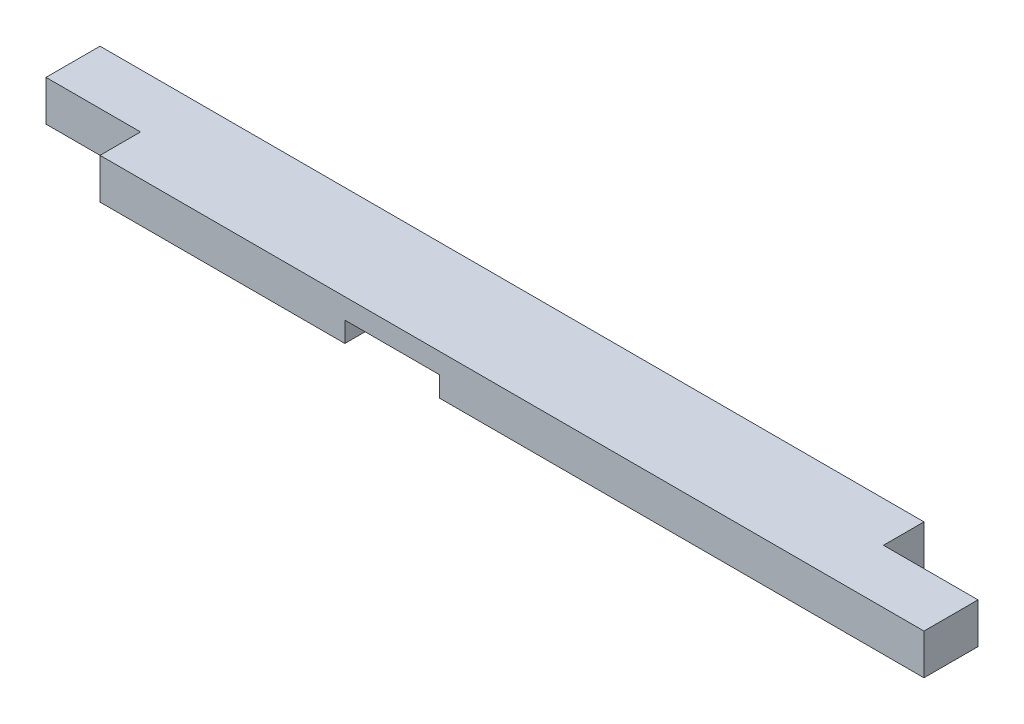
ISO-10303-21;
HEADER;
FILE_DESCRIPTION(('STEP AP214'),'2;1');
FILE_NAME('part.step','',(''),(''),'','','');
FILE_SCHEMA(('AUTOMOTIVE_DESIGN { 1 0 10303 214 1 1 1 1 }'));
ENDSEC;
DATA;
#1=APPLICATION_CONTEXT('core data for automotive mechanical design processes');
#2=APPLICATION_PROTOCOL_DEFINITION('international standard','automotive_design',2000,#1);
#3=PRODUCT_CONTEXT('',#1,'mechanical');
#4=PRODUCT('Part','Part','',(#3));
#5=PRODUCT_RELATED_PRODUCT_CATEGORY('part','',(#4));
#6=PRODUCT_DEFINITION_FORMATION('','',#4);
#7=PRODUCT_DEFINITION_CONTEXT('part definition',#1,'design');
#8=PRODUCT_DEFINITION('design','',#6,#7);
#9=PRODUCT_DEFINITION_SHAPE('','',#8);
#10=(LENGTH_UNIT() NAMED_UNIT(*) SI_UNIT(.MILLI.,.METRE.));
#11=(NAMED_UNIT(*) PLANE_ANGLE_UNIT() SI_UNIT($,.RADIAN.));
#12=(NAMED_UNIT(*) SI_UNIT($,.STERADIAN.) SOLID_ANGLE_UNIT());
#13=UNCERTAINTY_MEASURE_WITH_UNIT(LENGTH_MEASURE(1.E-05),#10,'distance_accuracy_value','');
#14=(GEOMETRIC_REPRESENTATION_CONTEXT(3) GLOBAL_UNCERTAINTY_ASSIGNED_CONTEXT((#13)) GLOBAL_UNIT_ASSIGNED_CONTEXT((#10,
#11,#12)) REPRESENTATION_CONTEXT('',''));
#15=CARTESIAN_POINT('',(0.,0.,0.));
#16=DIRECTION('',(0.,0.,1.));
#17=DIRECTION('',(1.,0.,0.));
#18=AXIS2_PLACEMENT_3D('',#15,#16,#17);
#19=CARTESIAN_POINT('',(0.,0.,0.));
#20=DIRECTION('',(0.,-1.,0.));
#21=DIRECTION('',(0.,0.,-1.));
#22=AXIS2_PLACEMENT_3D('',#19,#20,#21);
#23=PLANE('',#22);
#24=DIRECTION('',(-1.,0.,0.));
#25=VECTOR('',#24,1.);
#26=CARTESIAN_POINT('',(0.,0.,-38.1));
#27=LINE('',#26,#25);
#28=CARTESIAN_POINT('',(88.9,0.,-38.1));
#29=VERTEX_POINT('',#28);
#30=CARTESIAN_POINT('',(0.,0.,-38.1));
#31=VERTEX_POINT('',#30);
#32=EDGE_CURVE('E205',#29,#31,#27,.T.);
#33=ORIENTED_EDGE('',*,*,#32,.T.);
#34=DIRECTION('',(0.,0.,1.));
#35=VECTOR('',#34,1.);
#36=CARTESIAN_POINT('',(0.,0.,0.));
#37=LINE('',#36,#35);
#38=CARTESIAN_POINT('',(0.,0.,-88.9));
#39=VERTEX_POINT('',#38);
#40=EDGE_CURVE('E173',#39,#31,#37,.T.);
#41=ORIENTED_EDGE('',*,*,#40,.F.);
#42=DIRECTION('',(-1.,0.,0.));
#43=VECTOR('',#42,1.);
#44=CARTESIAN_POINT('',(0.,0.,-88.9));
#45=LINE('',#44,#43);
#46=CARTESIAN_POINT('',(319.1002,0.,-88.9));
#47=VERTEX_POINT('',#46);
#48=EDGE_CURVE('E153',#47,#39,#45,.T.);
#49=ORIENTED_EDGE('',*,*,#48,.F.);
#50=DIRECTION('',(0.,0.,-1.));
#51=VECTOR('',#50,1.);
#52=CARTESIAN_POINT('',(319.1002,0.,0.));
#53=LINE('',#52,#51);
#54=CARTESIAN_POINT('',(319.1002,0.,0.));
#55=VERTEX_POINT('',#54);
#56=EDGE_CURVE('E214',#55,#47,#53,.T.);
#57=ORIENTED_EDGE('',*,*,#56,.F.);
#58=DIRECTION('',(1.,0.,0.));
#59=VECTOR('',#58,1.);
#60=CARTESIAN_POINT('',(0.,0.,0.));
#61=LINE('',#60,#59);
#62=CARTESIAN_POINT('',(88.9,0.,0.));
#63=VERTEX_POINT('',#62);
#64=EDGE_CURVE('E176',#63,#55,#61,.T.);
#65=ORIENTED_EDGE('',*,*,#64,.F.);
#66=DIRECTION('',(0.,0.,-1.));
#67=VECTOR('',#66,1.);
#68=CARTESIAN_POINT('',(88.9,0.,0.));
#69=LINE('',#68,#67);
#70=EDGE_CURVE('E202',#63,#29,#69,.T.);
#71=ORIENTED_EDGE('',*,*,#70,.T.);
#72=EDGE_LOOP('',(#33,#41,#49,#57,#65,#71));
#73=FACE_BOUND('',#72,.T.);
#74=ADVANCED_FACE('F39',(#73),#23,.T.);
#75=CARTESIAN_POINT('',(0.,38.1,0.));
#76=DIRECTION('',(1.,0.,0.));
#77=DIRECTION('',(0.,0.,-1.));
#78=AXIS2_PLACEMENT_3D('',#75,#76,#77);
#79=PLANE('',#78);
#80=ORIENTED_EDGE('',*,*,#40,.T.);
#81=DIRECTION('',(0.,1.,0.));
#82=VECTOR('',#81,1.);
#83=CARTESIAN_POINT('',(0.,0.,-38.1));
#84=LINE('',#83,#82);
#85=CARTESIAN_POINT('',(0.,38.1,-38.1));
#86=VERTEX_POINT('',#85);
#87=EDGE_CURVE('E211',#31,#86,#84,.T.);
#88=ORIENTED_EDGE('',*,*,#87,.T.);
#89=DIRECTION('',(0.,0.,1.));
#90=VECTOR('',#89,1.);
#91=CARTESIAN_POINT('',(0.,38.1,0.));
#92=LINE('',#91,#90);
#93=CARTESIAN_POINT('',(0.,38.1,-88.9));
#94=VERTEX_POINT('',#93);
#95=EDGE_CURVE('E152',#94,#86,#92,.T.);
#96=ORIENTED_EDGE('',*,*,#95,.F.);
#97=DIRECTION('',(0.,-1.,0.));
#98=VECTOR('',#97,1.);
#99=CARTESIAN_POINT('',(0.,38.1,-88.9));
#100=LINE('',#99,#98);
#101=EDGE_CURVE('E47',#94,#39,#100,.T.);
#102=ORIENTED_EDGE('',*,*,#101,.T.);
#103=EDGE_LOOP('',(#80,#88,#96,#102));
#104=FACE_BOUND('',#103,.T.);
#105=ADVANCED_FACE('F41',(#104),#79,.F.);
#106=CARTESIAN_POINT('',(0.,38.1,0.));
#107=DIRECTION('',(0.,0.,-1.));
#108=DIRECTION('',(-1.,0.,0.));
#109=AXIS2_PLACEMENT_3D('',#106,#107,#108);
#110=PLANE('',#109);
#111=DIRECTION('',(1.,0.,0.));
#112=VECTOR('',#111,1.);
#113=CARTESIAN_POINT('',(0.,38.1,0.));
#114=LINE('',#113,#112);
#115=CARTESIAN_POINT('',(88.9,38.1,0.));
#116=VERTEX_POINT('',#115);
#117=CARTESIAN_POINT('',(863.6,38.1,0.));
#118=VERTEX_POINT('',#117);
#119=EDGE_CURVE('E156',#116,#118,#114,.T.);
#120=ORIENTED_EDGE('',*,*,#119,.F.);
#121=DIRECTION('',(0.,1.,0.));
#122=VECTOR('',#121,1.);
#123=CARTESIAN_POINT('',(88.9,0.,0.));
#124=LINE('',#123,#122);
#125=EDGE_CURVE('E62',#63,#116,#124,.T.);
#126=ORIENTED_EDGE('',*,*,#125,.F.);
#127=ORIENTED_EDGE('',*,*,#64,.T.);
#128=DIRECTION('',(0.,-1.,0.));
#129=VECTOR('',#128,1.);
#130=CARTESIAN_POINT('',(319.1002,19.05,0.));
#131=LINE('',#130,#129);
#132=CARTESIAN_POINT('',(319.1002,19.05,0.));
#133=VERTEX_POINT('',#132);
#134=EDGE_CURVE('E175',#133,#55,#131,.T.);
#135=ORIENTED_EDGE('',*,*,#134,.F.);
#136=DIRECTION('',(-1.,0.,0.));
#137=VECTOR('',#136,1.);
#138=CARTESIAN_POINT('',(319.1002,19.05,0.));
#139=LINE('',#138,#137);
#140=CARTESIAN_POINT('',(408.0002,19.05,0.));
#141=VERTEX_POINT('',#140);
#142=EDGE_CURVE('E227',#141,#133,#139,.T.);
#143=ORIENTED_EDGE('',*,*,#142,.F.);
#144=DIRECTION('',(0.,-1.,0.));
#145=VECTOR('',#144,1.);
#146=CARTESIAN_POINT('',(408.0002,19.05,0.));
#147=LINE('',#146,#145);
#148=CARTESIAN_POINT('',(408.0002,0.,0.));
#149=VERTEX_POINT('',#148);
#150=EDGE_CURVE('E188',#141,#149,#147,.T.);
#151=ORIENTED_EDGE('',*,*,#150,.T.);
#152=CARTESIAN_POINT('',(863.6,0.,0.));
#153=VERTEX_POINT('',#152);
#154=EDGE_CURVE('E174',#149,#153,#61,.T.);
#155=ORIENTED_EDGE('',*,*,#154,.T.);
#156=DIRECTION('',(0.,-1.,0.));
#157=VECTOR('',#156,1.);
#158=CARTESIAN_POINT('',(863.6,38.1,0.));
#159=LINE('',#158,#157);
#160=EDGE_CURVE('E11',#118,#153,#159,.T.);
#161=ORIENTED_EDGE('',*,*,#160,.F.);
#162=EDGE_LOOP('',(#120,#126,#127,#135,#143,#151,#155,#161));
#163=FACE_BOUND('',#162,.T.);
#164=ADVANCED_FACE('F185',(#163),#110,.F.);
#165=CARTESIAN_POINT('',(863.6,38.1,0.));
#166=DIRECTION('',(-1.,0.,0.));
#167=DIRECTION('',(0.,0.,1.));
#168=AXIS2_PLACEMENT_3D('',#165,#166,#167);
#169=PLANE('',#168);
#170=DIRECTION('',(0.,0.,-1.));
#171=VECTOR('',#170,1.);
#172=CARTESIAN_POINT('',(863.6,0.,0.));
#173=LINE('',#172,#171);
#174=CARTESIAN_POINT('',(863.6,0.,-50.8000000000001));
#175=VERTEX_POINT('',#174);
#176=EDGE_CURVE('E158',#153,#175,#173,.T.);
#177=ORIENTED_EDGE('',*,*,#176,.T.);
#178=DIRECTION('',(0.,1.,0.));
#179=VECTOR('',#178,1.);
#180=CARTESIAN_POINT('',(863.6,0.,-50.8000000000001));
#181=LINE('',#180,#179);
#182=CARTESIAN_POINT('',(863.6,38.1,-50.8000000000001));
#183=VERTEX_POINT('',#182);
#184=EDGE_CURVE('E198',#175,#183,#181,.T.);
#185=ORIENTED_EDGE('',*,*,#184,.T.);
#186=DIRECTION('',(0.,0.,-1.));
#187=VECTOR('',#186,1.);
#188=CARTESIAN_POINT('',(863.6,38.1,0.));
#189=LINE('',#188,#187);
#190=EDGE_CURVE('E166',#118,#183,#189,.T.);
#191=ORIENTED_EDGE('',*,*,#190,.F.);
#192=ORIENTED_EDGE('',*,*,#160,.T.);
#193=EDGE_LOOP('',(#177,#185,#191,#192));
#194=FACE_BOUND('',#193,.T.);
#195=ADVANCED_FACE('F191',(#194),#169,.F.);
#196=CARTESIAN_POINT('',(0.,38.1,-88.9));
#197=DIRECTION('',(0.,0.,1.));
#198=DIRECTION('',(1.,0.,0.));
#199=AXIS2_PLACEMENT_3D('',#196,#197,#198);
#200=PLANE('',#199);
#201=DIRECTION('',(-1.,0.,0.));
#202=VECTOR('',#201,1.);
#203=CARTESIAN_POINT('',(0.,38.1,-88.9));
#204=LINE('',#203,#202);
#205=CARTESIAN_POINT('',(774.700000000001,38.1,-88.9));
#206=VERTEX_POINT('',#205);
#207=EDGE_CURVE('E146',#206,#94,#204,.T.);
#208=ORIENTED_EDGE('',*,*,#207,.F.);
#209=DIRECTION('',(0.,1.,0.));
#210=VECTOR('',#209,1.);
#211=CARTESIAN_POINT('',(774.700000000001,0.,-88.9));
#212=LINE('',#211,#210);
#213=CARTESIAN_POINT('',(774.700000000001,0.,-88.9));
#214=VERTEX_POINT('',#213);
#215=EDGE_CURVE('E132',#214,#206,#212,.T.);
#216=ORIENTED_EDGE('',*,*,#215,.F.);
#217=CARTESIAN_POINT('',(408.0002,0.,-88.9));
#218=VERTEX_POINT('',#217);
#219=EDGE_CURVE('E143',#214,#218,#45,.T.);
#220=ORIENTED_EDGE('',*,*,#219,.T.);
#221=DIRECTION('',(0.,-1.,0.));
#222=VECTOR('',#221,1.);
#223=CARTESIAN_POINT('',(408.0002,19.05,-88.9));
#224=LINE('',#223,#222);
#225=CARTESIAN_POINT('',(408.0002,19.05,-88.9));
#226=VERTEX_POINT('',#225);
#227=EDGE_CURVE('E235',#226,#218,#224,.T.);
#228=ORIENTED_EDGE('',*,*,#227,.F.);
#229=DIRECTION('',(1.,0.,0.));
#230=VECTOR('',#229,1.);
#231=CARTESIAN_POINT('',(319.1002,19.05,-88.9));
#232=LINE('',#231,#230);
#233=CARTESIAN_POINT('',(319.1002,19.05,-88.9));
#234=VERTEX_POINT('',#233);
#235=EDGE_CURVE('E221',#234,#226,#232,.T.);
#236=ORIENTED_EDGE('',*,*,#235,.F.);
#237=DIRECTION('',(0.,-1.,0.));
#238=VECTOR('',#237,1.);
#239=CARTESIAN_POINT('',(319.1002,19.05,-88.9));
#240=LINE('',#239,#238);
#241=EDGE_CURVE('E230',#234,#47,#240,.T.);
#242=ORIENTED_EDGE('',*,*,#241,.T.);
#243=ORIENTED_EDGE('',*,*,#48,.T.);
#244=ORIENTED_EDGE('',*,*,#101,.F.);
#245=EDGE_LOOP('',(#208,#216,#220,#228,#236,#242,#243,#244));
#246=FACE_BOUND('',#245,.T.);
#247=ADVANCED_FACE('F141',(#246),#200,.F.);
#248=CARTESIAN_POINT('',(0.,38.1,0.));
#249=DIRECTION('',(0.,-1.,0.));
#250=DIRECTION('',(0.,0.,-1.));
#251=AXIS2_PLACEMENT_3D('',#248,#249,#250);
#252=PLANE('',#251);
#253=ORIENTED_EDGE('',*,*,#190,.T.);
#254=DIRECTION('',(1.,0.,0.));
#255=VECTOR('',#254,1.);
#256=CARTESIAN_POINT('',(863.6,38.1,-50.8000000000001));
#257=LINE('',#256,#255);
#258=CARTESIAN_POINT('',(774.700000000001,38.1,-50.8000000000002));
#259=VERTEX_POINT('',#258);
#260=EDGE_CURVE('E137',#259,#183,#257,.T.);
#261=ORIENTED_EDGE('',*,*,#260,.F.);
#262=DIRECTION('',(0.,0.,1.));
#263=VECTOR('',#262,1.);
#264=CARTESIAN_POINT('',(774.700000000001,38.1,-88.9));
#265=LINE('',#264,#263);
#266=EDGE_CURVE('E195',#206,#259,#265,.T.);
#267=ORIENTED_EDGE('',*,*,#266,.F.);
#268=ORIENTED_EDGE('',*,*,#207,.T.);
#269=ORIENTED_EDGE('',*,*,#95,.T.);
#270=DIRECTION('',(-1.,0.,0.));
#271=VECTOR('',#270,1.);
#272=CARTESIAN_POINT('',(0.,38.1,-38.1));
#273=LINE('',#272,#271);
#274=CARTESIAN_POINT('',(88.9,38.1,-38.1));
#275=VERTEX_POINT('',#274);
#276=EDGE_CURVE('E206',#275,#86,#273,.T.);
#277=ORIENTED_EDGE('',*,*,#276,.F.);
#278=DIRECTION('',(0.,0.,-1.));
#279=VECTOR('',#278,1.);
#280=CARTESIAN_POINT('',(88.9,38.1,0.));
#281=LINE('',#280,#279);
#282=EDGE_CURVE('E200',#116,#275,#281,.T.);
#283=ORIENTED_EDGE('',*,*,#282,.F.);
#284=ORIENTED_EDGE('',*,*,#119,.T.);
#285=EDGE_LOOP('',(#253,#261,#267,#268,#269,#277,#283,#284));
#286=FACE_BOUND('',#285,.T.);
#287=ADVANCED_FACE('F238',(#286),#252,.F.);
#288=DIRECTION('',(1.,0.,0.));
#289=VECTOR('',#288,1.);
#290=CARTESIAN_POINT('',(863.6,0.,-50.8000000000001));
#291=LINE('',#290,#289);
#292=CARTESIAN_POINT('',(774.700000000001,0.,-50.8000000000002));
#293=VERTEX_POINT('',#292);
#294=EDGE_CURVE('E54',#293,#175,#291,.T.);
#295=ORIENTED_EDGE('',*,*,#294,.T.);
#296=ORIENTED_EDGE('',*,*,#176,.F.);
#297=ORIENTED_EDGE('',*,*,#154,.F.);
#298=DIRECTION('',(0.,0.,1.));
#299=VECTOR('',#298,1.);
#300=CARTESIAN_POINT('',(408.0002,0.,0.));
#301=LINE('',#300,#299);
#302=EDGE_CURVE('E151',#218,#149,#301,.T.);
#303=ORIENTED_EDGE('',*,*,#302,.F.);
#304=ORIENTED_EDGE('',*,*,#219,.F.);
#305=DIRECTION('',(0.,0.,1.));
#306=VECTOR('',#305,1.);
#307=CARTESIAN_POINT('',(774.700000000001,0.,-88.9));
#308=LINE('',#307,#306);
#309=EDGE_CURVE('E128',#214,#293,#308,.T.);
#310=ORIENTED_EDGE('',*,*,#309,.T.);
#311=EDGE_LOOP('',(#295,#296,#297,#303,#304,#310));
#312=FACE_BOUND('',#311,.T.);
#313=ADVANCED_FACE('F149',(#312),#23,.T.);
#314=CARTESIAN_POINT('',(319.1002,19.05,0.));
#315=DIRECTION('',(-1.,0.,0.));
#316=DIRECTION('',(0.,0.,1.));
#317=AXIS2_PLACEMENT_3D('',#314,#315,#316);
#318=PLANE('',#317);
#319=ORIENTED_EDGE('',*,*,#56,.T.);
#320=ORIENTED_EDGE('',*,*,#241,.F.);
#321=DIRECTION('',(0.,0.,-1.));
#322=VECTOR('',#321,1.);
#323=CARTESIAN_POINT('',(319.1002,19.05,0.));
#324=LINE('',#323,#322);
#325=EDGE_CURVE('E218',#133,#234,#324,.T.);
#326=ORIENTED_EDGE('',*,*,#325,.F.);
#327=ORIENTED_EDGE('',*,*,#134,.T.);
#328=EDGE_LOOP('',(#319,#320,#326,#327));
#329=FACE_BOUND('',#328,.T.);
#330=ADVANCED_FACE('F245',(#329),#318,.F.);
#331=CARTESIAN_POINT('',(408.0002,19.05,0.));
#332=DIRECTION('',(1.,0.,0.));
#333=DIRECTION('',(0.,0.,-1.));
#334=AXIS2_PLACEMENT_3D('',#331,#332,#333);
#335=PLANE('',#334);
#336=ORIENTED_EDGE('',*,*,#302,.T.);
#337=ORIENTED_EDGE('',*,*,#150,.F.);
#338=DIRECTION('',(0.,0.,1.));
#339=VECTOR('',#338,1.);
#340=CARTESIAN_POINT('',(408.0002,19.05,0.));
#341=LINE('',#340,#339);
#342=EDGE_CURVE('E224',#226,#141,#341,.T.);
#343=ORIENTED_EDGE('',*,*,#342,.F.);
#344=ORIENTED_EDGE('',*,*,#227,.T.);
#345=EDGE_LOOP('',(#336,#337,#343,#344));
#346=FACE_BOUND('',#345,.T.);
#347=ADVANCED_FACE('F250',(#346),#335,.F.);
#348=CARTESIAN_POINT('',(0.,19.05,0.));
#349=DIRECTION('',(0.,-1.,0.));
#350=DIRECTION('',(0.,0.,-1.));
#351=AXIS2_PLACEMENT_3D('',#348,#349,#350);
#352=PLANE('',#351);
#353=ORIENTED_EDGE('',*,*,#325,.T.);
#354=ORIENTED_EDGE('',*,*,#235,.T.);
#355=ORIENTED_EDGE('',*,*,#342,.T.);
#356=ORIENTED_EDGE('',*,*,#142,.T.);
#357=EDGE_LOOP('',(#353,#354,#355,#356));
#358=FACE_BOUND('',#357,.T.);
#359=ADVANCED_FACE('F248',(#358),#352,.T.);
#360=CARTESIAN_POINT('',(0.,0.,-38.1));
#361=DIRECTION('',(0.,0.,-1.));
#362=DIRECTION('',(-1.,0.,0.));
#363=AXIS2_PLACEMENT_3D('',#360,#361,#362);
#364=PLANE('',#363);
#365=ORIENTED_EDGE('',*,*,#276,.T.);
#366=ORIENTED_EDGE('',*,*,#87,.F.);
#367=ORIENTED_EDGE('',*,*,#32,.F.);
#368=DIRECTION('',(0.,1.,0.));
#369=VECTOR('',#368,1.);
#370=CARTESIAN_POINT('',(88.9,0.,-38.1));
#371=LINE('',#370,#369);
#372=EDGE_CURVE('E215',#29,#275,#371,.T.);
#373=ORIENTED_EDGE('',*,*,#372,.T.);
#374=EDGE_LOOP('',(#365,#366,#367,#373));
#375=FACE_BOUND('',#374,.T.);
#376=ADVANCED_FACE('F257',(#375),#364,.F.);
#377=CARTESIAN_POINT('',(88.9,0.,0.));
#378=DIRECTION('',(1.,0.,0.));
#379=DIRECTION('',(0.,0.,-1.));
#380=AXIS2_PLACEMENT_3D('',#377,#378,#379);
#381=PLANE('',#380);
#382=ORIENTED_EDGE('',*,*,#282,.T.);
#383=ORIENTED_EDGE('',*,*,#372,.F.);
#384=ORIENTED_EDGE('',*,*,#70,.F.);
#385=ORIENTED_EDGE('',*,*,#125,.T.);
#386=EDGE_LOOP('',(#382,#383,#384,#385));
#387=FACE_BOUND('',#386,.T.);
#388=ADVANCED_FACE('F292',(#387),#381,.F.);
#389=CARTESIAN_POINT('',(863.6,0.,-50.8000000000001));
#390=DIRECTION('',(0.,0.,1.));
#391=DIRECTION('',(1.,0.,0.));
#392=AXIS2_PLACEMENT_3D('',#389,#390,#391);
#393=PLANE('',#392);
#394=ORIENTED_EDGE('',*,*,#260,.T.);
#395=ORIENTED_EDGE('',*,*,#184,.F.);
#396=ORIENTED_EDGE('',*,*,#294,.F.);
#397=DIRECTION('',(0.,1.,0.));
#398=VECTOR('',#397,1.);
#399=CARTESIAN_POINT('',(774.700000000001,0.,-50.8000000000002));
#400=LINE('',#399,#398);
#401=EDGE_CURVE('E134',#293,#259,#400,.T.);
#402=ORIENTED_EDGE('',*,*,#401,.T.);
#403=EDGE_LOOP('',(#394,#395,#396,#402));
#404=FACE_BOUND('',#403,.T.);
#405=ADVANCED_FACE('F301',(#404),#393,.F.);
#406=CARTESIAN_POINT('',(774.700000000001,0.,-88.9));
#407=DIRECTION('',(-1.,0.,0.));
#408=DIRECTION('',(0.,0.,1.));
#409=AXIS2_PLACEMENT_3D('',#406,#407,#408);
#410=PLANE('',#409);
#411=ORIENTED_EDGE('',*,*,#266,.T.);
#412=ORIENTED_EDGE('',*,*,#401,.F.);
#413=ORIENTED_EDGE('',*,*,#309,.F.);
#414=ORIENTED_EDGE('',*,*,#215,.T.);
#415=EDGE_LOOP('',(#411,#412,#413,#414));
#416=FACE_BOUND('',#415,.T.);
#417=ADVANCED_FACE('F131',(#416),#410,.F.);
#418=CLOSED_SHELL('',(#74,#105,#164,#195,#247,#287,#313,#330,#347,#359,#376,#388,#405,#417));
#419=MANIFOLD_SOLID_BREP('B2',#418);
#420=ADVANCED_BREP_SHAPE_REPRESENTATION('',(#18,#419),#14);
#421=SHAPE_DEFINITION_REPRESENTATION(#9,#420);
ENDSEC;
END-ISO-10303-21;
